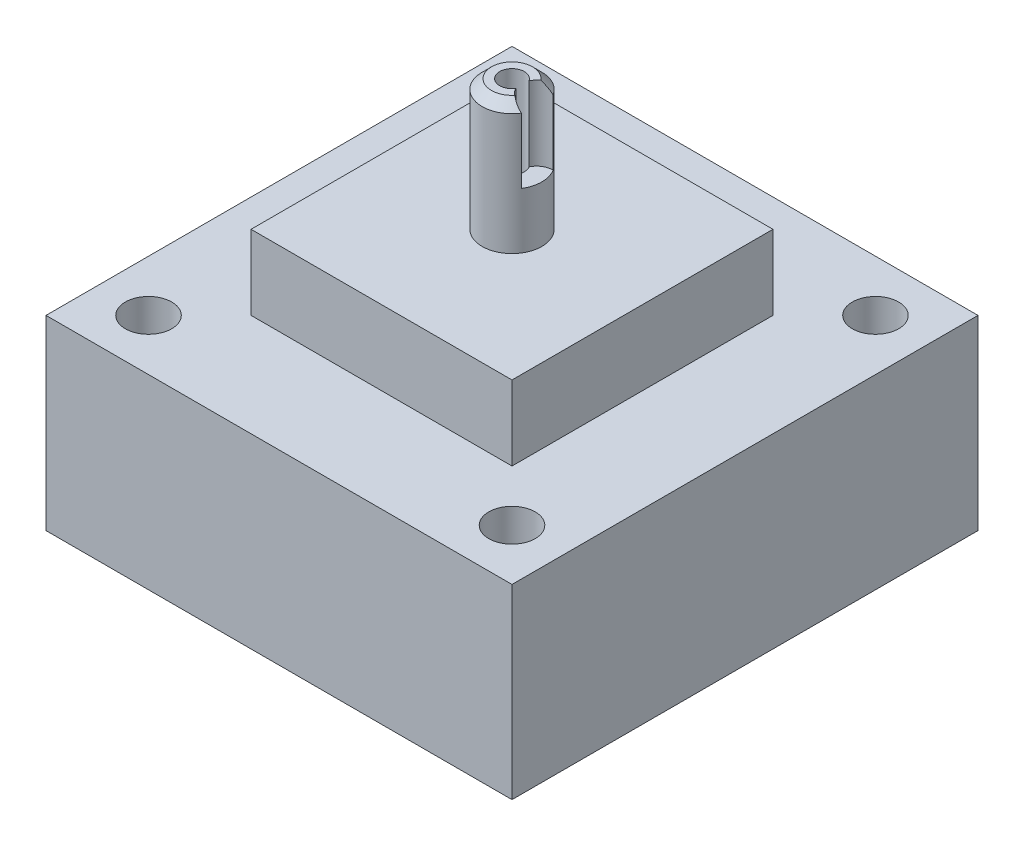
ISO-10303-21;
HEADER;
FILE_DESCRIPTION(('STEP AP214'),'2;1');
FILE_NAME('part.step','',(''),(''),'','','');
FILE_SCHEMA(('AUTOMOTIVE_DESIGN { 1 0 10303 214 1 1 1 1 }'));
ENDSEC;
DATA;
#1=APPLICATION_CONTEXT('core data for automotive mechanical design processes');
#2=APPLICATION_PROTOCOL_DEFINITION('international standard','automotive_design',2000,#1);
#3=PRODUCT_CONTEXT('',#1,'mechanical');
#4=PRODUCT('Part','Part','',(#3));
#5=PRODUCT_RELATED_PRODUCT_CATEGORY('part','',(#4));
#6=PRODUCT_DEFINITION_FORMATION('','',#4);
#7=PRODUCT_DEFINITION_CONTEXT('part definition',#1,'design');
#8=PRODUCT_DEFINITION('design','',#6,#7);
#9=PRODUCT_DEFINITION_SHAPE('','',#8);
#10=(LENGTH_UNIT() NAMED_UNIT(*) SI_UNIT(.MILLI.,.METRE.));
#11=(NAMED_UNIT(*) PLANE_ANGLE_UNIT() SI_UNIT($,.RADIAN.));
#12=(NAMED_UNIT(*) SI_UNIT($,.STERADIAN.) SOLID_ANGLE_UNIT());
#13=UNCERTAINTY_MEASURE_WITH_UNIT(LENGTH_MEASURE(1.E-05),#10,'distance_accuracy_value','');
#14=(GEOMETRIC_REPRESENTATION_CONTEXT(3) GLOBAL_UNCERTAINTY_ASSIGNED_CONTEXT((#13)) GLOBAL_UNIT_ASSIGNED_CONTEXT((#10,
#11,#12)) REPRESENTATION_CONTEXT('',''));
#15=CARTESIAN_POINT('',(0.,0.,0.));
#16=DIRECTION('',(0.,0.,1.));
#17=DIRECTION('',(1.,0.,0.));
#18=AXIS2_PLACEMENT_3D('',#15,#16,#17);
#19=CARTESIAN_POINT('',(-7.,4.,7.));
#20=DIRECTION('',(1.,0.,0.));
#21=DIRECTION('',(0.,0.,-1.));
#22=AXIS2_PLACEMENT_3D('',#19,#20,#21);
#23=PLANE('',#22);
#24=DIRECTION('',(0.,0.,1.));
#25=VECTOR('',#24,1.);
#26=CARTESIAN_POINT('',(-7.,0.,7.));
#27=LINE('',#26,#25);
#28=CARTESIAN_POINT('',(-7.,0.,-7.));
#29=VERTEX_POINT('',#28);
#30=CARTESIAN_POINT('',(-7.,0.,7.));
#31=VERTEX_POINT('',#30);
#32=EDGE_CURVE('E87',#29,#31,#27,.T.);
#33=ORIENTED_EDGE('',*,*,#32,.T.);
#34=DIRECTION('',(0.,-1.,0.));
#35=VECTOR('',#34,1.);
#36=CARTESIAN_POINT('',(-7.,4.,7.));
#37=LINE('',#36,#35);
#38=CARTESIAN_POINT('',(-7.,4.,7.));
#39=VERTEX_POINT('',#38);
#40=EDGE_CURVE('E110',#39,#31,#37,.T.);
#41=ORIENTED_EDGE('',*,*,#40,.F.);
#42=DIRECTION('',(0.,0.,1.));
#43=VECTOR('',#42,1.);
#44=CARTESIAN_POINT('',(-7.,4.,7.));
#45=LINE('',#44,#43);
#46=CARTESIAN_POINT('',(-7.,4.,-7.));
#47=VERTEX_POINT('',#46);
#48=EDGE_CURVE('E100',#47,#39,#45,.T.);
#49=ORIENTED_EDGE('',*,*,#48,.F.);
#50=DIRECTION('',(0.,-1.,0.));
#51=VECTOR('',#50,1.);
#52=CARTESIAN_POINT('',(-7.,4.,-7.));
#53=LINE('',#52,#51);
#54=EDGE_CURVE('E116',#47,#29,#53,.T.);
#55=ORIENTED_EDGE('',*,*,#54,.T.);
#56=EDGE_LOOP('',(#33,#41,#49,#55));
#57=FACE_BOUND('',#56,.T.);
#58=ADVANCED_FACE('F43',(#57),#23,.F.);
#59=CARTESIAN_POINT('',(-7.,4.,7.));
#60=DIRECTION('',(0.,0.,-1.));
#61=DIRECTION('',(-1.,0.,0.));
#62=AXIS2_PLACEMENT_3D('',#59,#60,#61);
#63=PLANE('',#62);
#64=DIRECTION('',(1.,0.,0.));
#65=VECTOR('',#64,1.);
#66=CARTESIAN_POINT('',(-7.,0.,7.));
#67=LINE('',#66,#65);
#68=CARTESIAN_POINT('',(7.,0.,7.));
#69=VERTEX_POINT('',#68);
#70=EDGE_CURVE('E108',#31,#69,#67,.T.);
#71=ORIENTED_EDGE('',*,*,#70,.T.);
#72=DIRECTION('',(0.,-1.,0.));
#73=VECTOR('',#72,1.);
#74=CARTESIAN_POINT('',(7.,4.,7.));
#75=LINE('',#74,#73);
#76=CARTESIAN_POINT('',(7.,4.,7.));
#77=VERTEX_POINT('',#76);
#78=EDGE_CURVE('E106',#77,#69,#75,.T.);
#79=ORIENTED_EDGE('',*,*,#78,.F.);
#80=DIRECTION('',(1.,0.,0.));
#81=VECTOR('',#80,1.);
#82=CARTESIAN_POINT('',(-7.,4.,7.));
#83=LINE('',#82,#81);
#84=EDGE_CURVE('E93',#39,#77,#83,.T.);
#85=ORIENTED_EDGE('',*,*,#84,.F.);
#86=ORIENTED_EDGE('',*,*,#40,.T.);
#87=EDGE_LOOP('',(#71,#79,#85,#86));
#88=FACE_BOUND('',#87,.T.);
#89=ADVANCED_FACE('F107',(#88),#63,.F.);
#90=CARTESIAN_POINT('',(7.,4.,7.));
#91=DIRECTION('',(-1.,0.,0.));
#92=DIRECTION('',(0.,0.,1.));
#93=AXIS2_PLACEMENT_3D('',#90,#91,#92);
#94=PLANE('',#93);
#95=DIRECTION('',(0.,0.,-1.));
#96=VECTOR('',#95,1.);
#97=CARTESIAN_POINT('',(7.,0.,7.));
#98=LINE('',#97,#96);
#99=CARTESIAN_POINT('',(7.,0.,-7.));
#100=VERTEX_POINT('',#99);
#101=EDGE_CURVE('E79',#69,#100,#98,.T.);
#102=ORIENTED_EDGE('',*,*,#101,.T.);
#103=DIRECTION('',(0.,-1.,0.));
#104=VECTOR('',#103,1.);
#105=CARTESIAN_POINT('',(7.,4.,-7.));
#106=LINE('',#105,#104);
#107=CARTESIAN_POINT('',(7.,4.,-7.));
#108=VERTEX_POINT('',#107);
#109=EDGE_CURVE('E111',#108,#100,#106,.T.);
#110=ORIENTED_EDGE('',*,*,#109,.F.);
#111=DIRECTION('',(0.,0.,-1.));
#112=VECTOR('',#111,1.);
#113=CARTESIAN_POINT('',(7.,4.,7.));
#114=LINE('',#113,#112);
#115=EDGE_CURVE('E97',#77,#108,#114,.T.);
#116=ORIENTED_EDGE('',*,*,#115,.F.);
#117=ORIENTED_EDGE('',*,*,#78,.T.);
#118=EDGE_LOOP('',(#102,#110,#116,#117));
#119=FACE_BOUND('',#118,.T.);
#120=ADVANCED_FACE('F113',(#119),#94,.F.);
#121=CARTESIAN_POINT('',(-7.,4.,-7.));
#122=DIRECTION('',(0.,0.,1.));
#123=DIRECTION('',(1.,0.,0.));
#124=AXIS2_PLACEMENT_3D('',#121,#122,#123);
#125=PLANE('',#124);
#126=DIRECTION('',(-1.,0.,0.));
#127=VECTOR('',#126,1.);
#128=CARTESIAN_POINT('',(-7.,0.,-7.));
#129=LINE('',#128,#127);
#130=EDGE_CURVE('E124',#100,#29,#129,.T.);
#131=ORIENTED_EDGE('',*,*,#130,.T.);
#132=ORIENTED_EDGE('',*,*,#54,.F.);
#133=DIRECTION('',(-1.,0.,0.));
#134=VECTOR('',#133,1.);
#135=CARTESIAN_POINT('',(-7.,4.,-7.));
#136=LINE('',#135,#134);
#137=EDGE_CURVE('E66',#108,#47,#136,.T.);
#138=ORIENTED_EDGE('',*,*,#137,.F.);
#139=ORIENTED_EDGE('',*,*,#109,.T.);
#140=EDGE_LOOP('',(#131,#132,#138,#139));
#141=FACE_BOUND('',#140,.T.);
#142=ADVANCED_FACE('F359',(#141),#125,.F.);
#143=CARTESIAN_POINT('',(0.,4.,0.));
#144=DIRECTION('',(0.,-1.,0.));
#145=DIRECTION('',(0.,0.,-1.));
#146=AXIS2_PLACEMENT_3D('',#143,#144,#145);
#147=PLANE('',#146);
#148=CARTESIAN_POINT('',(0.,4.,0.));
#149=DIRECTION('',(0.,-1.,0.));
#150=DIRECTION('',(0.,0.,-1.));
#151=AXIS2_PLACEMENT_3D('',#148,#149,#150);
#152=CIRCLE('',#151,1.6);
#153=CARTESIAN_POINT('',(0.,4.,-1.6));
#154=VERTEX_POINT('',#153);
#155=EDGE_CURVE('E236',#154,#154,#152,.T.);
#156=ORIENTED_EDGE('',*,*,#155,.T.);
#157=EDGE_LOOP('',(#156));
#158=FACE_BOUND('',#157,.T.);
#159=ORIENTED_EDGE('',*,*,#48,.T.);
#160=ORIENTED_EDGE('',*,*,#84,.T.);
#161=ORIENTED_EDGE('',*,*,#115,.T.);
#162=ORIENTED_EDGE('',*,*,#137,.T.);
#163=EDGE_LOOP('',(#159,#160,#161,#162));
#164=FACE_BOUND('',#163,.T.);
#165=ADVANCED_FACE('F95',(#158,#164),#147,.F.);
#166=CARTESIAN_POINT('',(0.,-10.,0.));
#167=DIRECTION('',(0.,-1.,0.));
#168=DIRECTION('',(0.,0.,-1.));
#169=AXIS2_PLACEMENT_3D('',#166,#167,#168);
#170=PLANE('',#169);
#171=CARTESIAN_POINT('',(0.,-10.,0.));
#172=DIRECTION('',(0.,-1.,0.));
#173=DIRECTION('',(0.,0.,-1.));
#174=AXIS2_PLACEMENT_3D('',#171,#172,#173);
#175=CIRCLE('',#174,4.23);
#176=CARTESIAN_POINT('',(0.,-10.,-4.23));
#177=VERTEX_POINT('',#176);
#178=EDGE_CURVE('E244',#177,#177,#175,.T.);
#179=ORIENTED_EDGE('',*,*,#178,.F.);
#180=EDGE_LOOP('',(#179));
#181=FACE_BOUND('',#180,.T.);
#182=CARTESIAN_POINT('',(9.74999999999993,-10.,-9.75000000000006));
#183=DIRECTION('',(0.,-1.,0.));
#184=DIRECTION('',(0.,0.,-1.));
#185=AXIS2_PLACEMENT_3D('',#182,#183,#184);
#186=CIRCLE('',#185,1.2446);
#187=CARTESIAN_POINT('',(9.74999999999993,-10.,-10.9946000000001));
#188=VERTEX_POINT('',#187);
#189=EDGE_CURVE('E257',#188,#188,#186,.T.);
#190=ORIENTED_EDGE('',*,*,#189,.F.);
#191=EDGE_LOOP('',(#190));
#192=FACE_BOUND('',#191,.T.);
#193=CARTESIAN_POINT('',(-9.75,-10.,9.75));
#194=DIRECTION('',(0.,-1.,0.));
#195=DIRECTION('',(0.,0.,-1.));
#196=AXIS2_PLACEMENT_3D('',#193,#194,#195);
#197=CIRCLE('',#196,1.2446);
#198=CARTESIAN_POINT('',(-9.75,-10.,8.5054));
#199=VERTEX_POINT('',#198);
#200=EDGE_CURVE('E269',#199,#199,#197,.T.);
#201=ORIENTED_EDGE('',*,*,#200,.F.);
#202=EDGE_LOOP('',(#201));
#203=FACE_BOUND('',#202,.T.);
#204=DIRECTION('',(1.,0.,0.));
#205=VECTOR('',#204,1.);
#206=CARTESIAN_POINT('',(-12.5,-10.,-12.5));
#207=LINE('',#206,#205);
#208=CARTESIAN_POINT('',(-12.5,-10.,-12.5));
#209=VERTEX_POINT('',#208);
#210=CARTESIAN_POINT('',(12.5,-10.,-12.5));
#211=VERTEX_POINT('',#210);
#212=EDGE_CURVE('E275',#209,#211,#207,.T.);
#213=ORIENTED_EDGE('',*,*,#212,.T.);
#214=DIRECTION('',(0.,0.,1.));
#215=VECTOR('',#214,1.);
#216=CARTESIAN_POINT('',(12.5,-10.,-12.5));
#217=LINE('',#216,#215);
#218=CARTESIAN_POINT('',(12.5,-10.,12.5));
#219=VERTEX_POINT('',#218);
#220=EDGE_CURVE('E278',#211,#219,#217,.T.);
#221=ORIENTED_EDGE('',*,*,#220,.T.);
#222=DIRECTION('',(-1.,0.,0.));
#223=VECTOR('',#222,1.);
#224=CARTESIAN_POINT('',(-12.5,-10.,12.5));
#225=LINE('',#224,#223);
#226=CARTESIAN_POINT('',(-12.5,-10.,12.5));
#227=VERTEX_POINT('',#226);
#228=EDGE_CURVE('E281',#219,#227,#225,.T.);
#229=ORIENTED_EDGE('',*,*,#228,.T.);
#230=DIRECTION('',(0.,0.,-1.));
#231=VECTOR('',#230,1.);
#232=CARTESIAN_POINT('',(-12.5,-10.,-12.5));
#233=LINE('',#232,#231);
#234=EDGE_CURVE('E283',#227,#209,#233,.T.);
#235=ORIENTED_EDGE('',*,*,#234,.T.);
#236=EDGE_LOOP('',(#213,#221,#229,#235));
#237=FACE_BOUND('',#236,.T.);
#238=CARTESIAN_POINT('',(9.75000000000004,-10.,9.74999999999996));
#239=DIRECTION('',(0.,-1.,0.));
#240=DIRECTION('',(0.,0.,-1.));
#241=AXIS2_PLACEMENT_3D('',#238,#239,#240);
#242=CIRCLE('',#241,1.2446);
#243=CARTESIAN_POINT('',(9.75000000000004,-10.,8.50539999999996));
#244=VERTEX_POINT('',#243);
#245=EDGE_CURVE('E263',#244,#244,#242,.T.);
#246=ORIENTED_EDGE('',*,*,#245,.F.);
#247=EDGE_LOOP('',(#246));
#248=FACE_BOUND('',#247,.T.);
#249=CARTESIAN_POINT('',(-9.7500000000001,-10.,-9.7499999999999));
#250=DIRECTION('',(0.,-1.,0.));
#251=DIRECTION('',(0.,0.,-1.));
#252=AXIS2_PLACEMENT_3D('',#249,#250,#251);
#253=CIRCLE('',#252,1.2446);
#254=CARTESIAN_POINT('',(-9.7500000000001,-10.,-10.9945999999999));
#255=VERTEX_POINT('',#254);
#256=EDGE_CURVE('E251',#255,#255,#253,.T.);
#257=ORIENTED_EDGE('',*,*,#256,.F.);
#258=EDGE_LOOP('',(#257));
#259=FACE_BOUND('',#258,.T.);
#260=ADVANCED_FACE('F324',(#181,#192,#203,#237,#248,#259),#170,.T.);
#261=CARTESIAN_POINT('',(0.,0.,0.));
#262=DIRECTION('',(0.,-1.,0.));
#263=DIRECTION('',(0.,0.,-1.));
#264=AXIS2_PLACEMENT_3D('',#261,#262,#263);
#265=PLANE('',#264);
#266=ORIENTED_EDGE('',*,*,#32,.F.);
#267=ORIENTED_EDGE('',*,*,#130,.F.);
#268=ORIENTED_EDGE('',*,*,#101,.F.);
#269=ORIENTED_EDGE('',*,*,#70,.F.);
#270=EDGE_LOOP('',(#266,#267,#268,#269));
#271=FACE_BOUND('',#270,.T.);
#272=DIRECTION('',(1.,0.,0.));
#273=VECTOR('',#272,1.);
#274=CARTESIAN_POINT('',(-12.5,0.,-12.5));
#275=LINE('',#274,#273);
#276=CARTESIAN_POINT('',(-12.5,0.,-12.5));
#277=VERTEX_POINT('',#276);
#278=CARTESIAN_POINT('',(12.5,0.,-12.5));
#279=VERTEX_POINT('',#278);
#280=EDGE_CURVE('E272',#277,#279,#275,.T.);
#281=ORIENTED_EDGE('',*,*,#280,.F.);
#282=DIRECTION('',(0.,0.,-1.));
#283=VECTOR('',#282,1.);
#284=CARTESIAN_POINT('',(-12.5,0.,-12.5));
#285=LINE('',#284,#283);
#286=CARTESIAN_POINT('',(-12.5,0.,12.5));
#287=VERTEX_POINT('',#286);
#288=EDGE_CURVE('E279',#287,#277,#285,.T.);
#289=ORIENTED_EDGE('',*,*,#288,.F.);
#290=DIRECTION('',(-1.,0.,0.));
#291=VECTOR('',#290,1.);
#292=CARTESIAN_POINT('',(-12.5,0.,12.5));
#293=LINE('',#292,#291);
#294=CARTESIAN_POINT('',(12.5,0.,12.5));
#295=VERTEX_POINT('',#294);
#296=EDGE_CURVE('E290',#295,#287,#293,.T.);
#297=ORIENTED_EDGE('',*,*,#296,.F.);
#298=DIRECTION('',(0.,0.,1.));
#299=VECTOR('',#298,1.);
#300=CARTESIAN_POINT('',(12.5,0.,-12.5));
#301=LINE('',#300,#299);
#302=EDGE_CURVE('E288',#279,#295,#301,.T.);
#303=ORIENTED_EDGE('',*,*,#302,.F.);
#304=EDGE_LOOP('',(#281,#289,#297,#303));
#305=FACE_BOUND('',#304,.T.);
#306=CARTESIAN_POINT('',(-9.75,0.,9.75));
#307=DIRECTION('',(0.,-1.,0.));
#308=DIRECTION('',(0.,0.,-1.));
#309=AXIS2_PLACEMENT_3D('',#306,#307,#308);
#310=CIRCLE('',#309,1.2446);
#311=CARTESIAN_POINT('',(-9.75,0.,8.5054));
#312=VERTEX_POINT('',#311);
#313=EDGE_CURVE('E266',#312,#312,#310,.T.);
#314=ORIENTED_EDGE('',*,*,#313,.T.);
#315=EDGE_LOOP('',(#314));
#316=FACE_BOUND('',#315,.T.);
#317=CARTESIAN_POINT('',(9.75000000000004,0.,9.74999999999996));
#318=DIRECTION('',(0.,-1.,0.));
#319=DIRECTION('',(0.,0.,-1.));
#320=AXIS2_PLACEMENT_3D('',#317,#318,#319);
#321=CIRCLE('',#320,1.2446);
#322=CARTESIAN_POINT('',(9.75000000000004,0.,8.50539999999996));
#323=VERTEX_POINT('',#322);
#324=EDGE_CURVE('E260',#323,#323,#321,.T.);
#325=ORIENTED_EDGE('',*,*,#324,.T.);
#326=EDGE_LOOP('',(#325));
#327=FACE_BOUND('',#326,.T.);
#328=CARTESIAN_POINT('',(9.74999999999993,0.,-9.75000000000006));
#329=DIRECTION('',(0.,-1.,0.));
#330=DIRECTION('',(0.,0.,-1.));
#331=AXIS2_PLACEMENT_3D('',#328,#329,#330);
#332=CIRCLE('',#331,1.2446);
#333=CARTESIAN_POINT('',(9.74999999999993,0.,-10.9946000000001));
#334=VERTEX_POINT('',#333);
#335=EDGE_CURVE('E254',#334,#334,#332,.T.);
#336=ORIENTED_EDGE('',*,*,#335,.T.);
#337=EDGE_LOOP('',(#336));
#338=FACE_BOUND('',#337,.T.);
#339=CARTESIAN_POINT('',(-9.7500000000001,0.,-9.7499999999999));
#340=DIRECTION('',(0.,-1.,0.));
#341=DIRECTION('',(0.,0.,-1.));
#342=AXIS2_PLACEMENT_3D('',#339,#340,#341);
#343=CIRCLE('',#342,1.2446);
#344=CARTESIAN_POINT('',(-9.7500000000001,0.,-10.9945999999999));
#345=VERTEX_POINT('',#344);
#346=EDGE_CURVE('E248',#345,#345,#343,.T.);
#347=ORIENTED_EDGE('',*,*,#346,.T.);
#348=EDGE_LOOP('',(#347));
#349=FACE_BOUND('',#348,.T.);
#350=ADVANCED_FACE('F313',(#271,#305,#316,#327,#338,#349),#265,.F.);
#351=CARTESIAN_POINT('',(-12.5,-10.,-12.5));
#352=DIRECTION('',(0.,0.,1.));
#353=DIRECTION('',(1.,0.,0.));
#354=AXIS2_PLACEMENT_3D('',#351,#352,#353);
#355=PLANE('',#354);
#356=ORIENTED_EDGE('',*,*,#280,.T.);
#357=DIRECTION('',(0.,1.,0.));
#358=VECTOR('',#357,1.);
#359=CARTESIAN_POINT('',(12.5,-10.,-12.5));
#360=LINE('',#359,#358);
#361=EDGE_CURVE('E121',#211,#279,#360,.T.);
#362=ORIENTED_EDGE('',*,*,#361,.F.);
#363=ORIENTED_EDGE('',*,*,#212,.F.);
#364=DIRECTION('',(0.,1.,0.));
#365=VECTOR('',#364,1.);
#366=CARTESIAN_POINT('',(-12.5,-10.,-12.5));
#367=LINE('',#366,#365);
#368=EDGE_CURVE('E285',#209,#277,#367,.T.);
#369=ORIENTED_EDGE('',*,*,#368,.T.);
#370=EDGE_LOOP('',(#356,#362,#363,#369));
#371=FACE_BOUND('',#370,.T.);
#372=ADVANCED_FACE('F309',(#371),#355,.F.);
#373=CARTESIAN_POINT('',(12.5,-10.,-12.5));
#374=DIRECTION('',(-1.,0.,0.));
#375=DIRECTION('',(0.,0.,1.));
#376=AXIS2_PLACEMENT_3D('',#373,#374,#375);
#377=PLANE('',#376);
#378=ORIENTED_EDGE('',*,*,#302,.T.);
#379=DIRECTION('',(0.,1.,0.));
#380=VECTOR('',#379,1.);
#381=CARTESIAN_POINT('',(12.5,-10.,12.5));
#382=LINE('',#381,#380);
#383=EDGE_CURVE('E298',#219,#295,#382,.T.);
#384=ORIENTED_EDGE('',*,*,#383,.F.);
#385=ORIENTED_EDGE('',*,*,#220,.F.);
#386=ORIENTED_EDGE('',*,*,#361,.T.);
#387=EDGE_LOOP('',(#378,#384,#385,#386));
#388=FACE_BOUND('',#387,.T.);
#389=ADVANCED_FACE('F304',(#388),#377,.F.);
#390=CARTESIAN_POINT('',(-12.5,-10.,12.5));
#391=DIRECTION('',(0.,0.,-1.));
#392=DIRECTION('',(-1.,0.,0.));
#393=AXIS2_PLACEMENT_3D('',#390,#391,#392);
#394=PLANE('',#393);
#395=ORIENTED_EDGE('',*,*,#296,.T.);
#396=DIRECTION('',(0.,1.,0.));
#397=VECTOR('',#396,1.);
#398=CARTESIAN_POINT('',(-12.5,-10.,12.5));
#399=LINE('',#398,#397);
#400=EDGE_CURVE('E295',#227,#287,#399,.T.);
#401=ORIENTED_EDGE('',*,*,#400,.F.);
#402=ORIENTED_EDGE('',*,*,#228,.F.);
#403=ORIENTED_EDGE('',*,*,#383,.T.);
#404=EDGE_LOOP('',(#395,#401,#402,#403));
#405=FACE_BOUND('',#404,.T.);
#406=ADVANCED_FACE('F318',(#405),#394,.F.);
#407=CARTESIAN_POINT('',(-12.5,-10.,-12.5));
#408=DIRECTION('',(1.,0.,0.));
#409=DIRECTION('',(0.,0.,-1.));
#410=AXIS2_PLACEMENT_3D('',#407,#408,#409);
#411=PLANE('',#410);
#412=ORIENTED_EDGE('',*,*,#288,.T.);
#413=ORIENTED_EDGE('',*,*,#368,.F.);
#414=ORIENTED_EDGE('',*,*,#234,.F.);
#415=ORIENTED_EDGE('',*,*,#400,.T.);
#416=EDGE_LOOP('',(#412,#413,#414,#415));
#417=FACE_BOUND('',#416,.T.);
#418=ADVANCED_FACE('F322',(#417),#411,.F.);
#419=CARTESIAN_POINT('',(-9.75,-10.,9.75));
#420=DIRECTION('',(0.,1.,0.));
#421=DIRECTION('',(0.,0.,1.));
#422=AXIS2_PLACEMENT_3D('',#419,#420,#421);
#423=CYLINDRICAL_SURFACE('',#422,1.2446);
#424=ORIENTED_EDGE('',*,*,#200,.T.);
#425=EDGE_LOOP('',(#424));
#426=FACE_BOUND('',#425,.T.);
#427=ORIENTED_EDGE('',*,*,#313,.F.);
#428=EDGE_LOOP('',(#427));
#429=FACE_BOUND('',#428,.T.);
#430=ADVANCED_FACE('F352',(#426,#429),#423,.F.);
#431=CARTESIAN_POINT('',(9.75000000000004,-10.,9.74999999999996));
#432=DIRECTION('',(0.,1.,0.));
#433=DIRECTION('',(0.,0.,1.));
#434=AXIS2_PLACEMENT_3D('',#431,#432,#433);
#435=CYLINDRICAL_SURFACE('',#434,1.2446);
#436=ORIENTED_EDGE('',*,*,#245,.T.);
#437=EDGE_LOOP('',(#436));
#438=FACE_BOUND('',#437,.T.);
#439=ORIENTED_EDGE('',*,*,#324,.F.);
#440=EDGE_LOOP('',(#439));
#441=FACE_BOUND('',#440,.T.);
#442=ADVANCED_FACE('F425',(#438,#441),#435,.F.);
#443=CARTESIAN_POINT('',(9.74999999999993,-10.,-9.75000000000006));
#444=DIRECTION('',(0.,1.,0.));
#445=DIRECTION('',(0.,0.,1.));
#446=AXIS2_PLACEMENT_3D('',#443,#444,#445);
#447=CYLINDRICAL_SURFACE('',#446,1.2446);
#448=ORIENTED_EDGE('',*,*,#189,.T.);
#449=EDGE_LOOP('',(#448));
#450=FACE_BOUND('',#449,.T.);
#451=ORIENTED_EDGE('',*,*,#335,.F.);
#452=EDGE_LOOP('',(#451));
#453=FACE_BOUND('',#452,.T.);
#454=ADVANCED_FACE('F337',(#450,#453),#447,.F.);
#455=CARTESIAN_POINT('',(-9.7500000000001,-10.,-9.7499999999999));
#456=DIRECTION('',(0.,1.,0.));
#457=DIRECTION('',(0.,0.,1.));
#458=AXIS2_PLACEMENT_3D('',#455,#456,#457);
#459=CYLINDRICAL_SURFACE('',#458,1.2446);
#460=ORIENTED_EDGE('',*,*,#256,.T.);
#461=EDGE_LOOP('',(#460));
#462=FACE_BOUND('',#461,.T.);
#463=ORIENTED_EDGE('',*,*,#346,.F.);
#464=EDGE_LOOP('',(#463));
#465=FACE_BOUND('',#464,.T.);
#466=ADVANCED_FACE('F333',(#462,#465),#459,.F.);
#467=CARTESIAN_POINT('',(0.,-0.199999999999999,0.));
#468=DIRECTION('',(0.,-1.,0.));
#469=DIRECTION('',(0.,0.,-1.));
#470=AXIS2_PLACEMENT_3D('',#467,#468,#469);
#471=CYLINDRICAL_SURFACE('',#470,4.23);
#472=CARTESIAN_POINT('',(0.,-0.199999999999999,0.));
#473=DIRECTION('',(0.,-1.,0.));
#474=DIRECTION('',(0.,0.,-1.));
#475=AXIS2_PLACEMENT_3D('',#472,#473,#474);
#476=CIRCLE('',#475,4.23);
#477=CARTESIAN_POINT('',(0.,-0.199999999999999,-4.23));
#478=VERTEX_POINT('',#477);
#479=EDGE_CURVE('E245',#478,#478,#476,.T.);
#480=ORIENTED_EDGE('',*,*,#479,.F.);
#481=EDGE_LOOP('',(#480));
#482=FACE_BOUND('',#481,.T.);
#483=ORIENTED_EDGE('',*,*,#178,.T.);
#484=EDGE_LOOP('',(#483));
#485=FACE_BOUND('',#484,.T.);
#486=ADVANCED_FACE('F336',(#482,#485),#471,.F.);
#487=CARTESIAN_POINT('',(0.,-0.199999999999999,0.));
#488=DIRECTION('',(0.,-1.,0.));
#489=DIRECTION('',(0.,0.,-1.));
#490=AXIS2_PLACEMENT_3D('',#487,#488,#489);
#491=PLANE('',#490);
#492=CARTESIAN_POINT('',(0.,-0.199999999999999,0.));
#493=DIRECTION('',(0.,-1.,0.));
#494=DIRECTION('',(0.,0.,-1.));
#495=AXIS2_PLACEMENT_3D('',#492,#493,#494);
#496=CIRCLE('',#495,0.660399999999999);
#497=CARTESIAN_POINT('',(0.,-0.199999999999999,-0.660399999999999));
#498=VERTEX_POINT('',#497);
#499=EDGE_CURVE('E131',#498,#498,#496,.T.);
#500=ORIENTED_EDGE('',*,*,#499,.F.);
#501=EDGE_LOOP('',(#500));
#502=FACE_BOUND('',#501,.T.);
#503=ORIENTED_EDGE('',*,*,#479,.T.);
#504=EDGE_LOOP('',(#503));
#505=FACE_BOUND('',#504,.T.);
#506=ADVANCED_FACE('F457',(#502,#505),#491,.T.);
#507=CARTESIAN_POINT('',(0.,11.,-1.1));
#508=DIRECTION('',(0.,1.,0.));
#509=DIRECTION('',(0.,0.,1.));
#510=AXIS2_PLACEMENT_3D('',#507,#508,#509);
#511=PLANE('',#510);
#512=CARTESIAN_POINT('',(1.33462181153422,11.,0.));
#513=DIRECTION('',(0.,1.,0.));
#514=DIRECTION('',(0.,0.,1.));
#515=AXIS2_PLACEMENT_3D('',#512,#513,#514);
#516=CIRCLE('',#515,0.85);
#517=CARTESIAN_POINT('',(0.849946913880746,11.,-0.698276623971186));
#518=VERTEX_POINT('',#517);
#519=CARTESIAN_POINT('',(0.560025142292735,11.,-0.350000000000004));
#520=VERTEX_POINT('',#519);
#521=EDGE_CURVE('E217',#518,#520,#516,.T.);
#522=ORIENTED_EDGE('',*,*,#521,.F.);
#523=CARTESIAN_POINT('',(0.,11.,0.));
#524=DIRECTION('',(0.,-1.,0.));
#525=DIRECTION('',(0.,0.,-1.));
#526=AXIS2_PLACEMENT_3D('',#523,#524,#525);
#527=CIRCLE('',#526,1.1);
#528=CARTESIAN_POINT('',(0.849946913880746,11.,0.698276623971186));
#529=VERTEX_POINT('',#528);
#530=EDGE_CURVE('E134',#529,#518,#527,.T.);
#531=ORIENTED_EDGE('',*,*,#530,.F.);
#532=CARTESIAN_POINT('',(0.560025142292735,11.,0.350000000000004));
#533=VERTEX_POINT('',#532);
#534=EDGE_CURVE('E231',#533,#529,#516,.T.);
#535=ORIENTED_EDGE('',*,*,#534,.F.);
#536=CARTESIAN_POINT('',(0.,11.,0.));
#537=DIRECTION('',(0.,-1.,0.));
#538=DIRECTION('',(0.,0.,-1.));
#539=AXIS2_PLACEMENT_3D('',#536,#537,#538);
#540=CIRCLE('',#539,0.6604);
#541=EDGE_CURVE('E229',#533,#520,#540,.T.);
#542=ORIENTED_EDGE('',*,*,#541,.T.);
#543=EDGE_LOOP('',(#522,#531,#535,#542));
#544=FACE_BOUND('',#543,.T.);
#545=ADVANCED_FACE('F226',(#544),#511,.T.);
#546=CARTESIAN_POINT('',(0.,4.,0.));
#547=DIRECTION('',(0.,-1.,0.));
#548=DIRECTION('',(0.,0.,-1.));
#549=AXIS2_PLACEMENT_3D('',#546,#547,#548);
#550=CYLINDRICAL_SURFACE('',#549,0.660400000000001);
#551=DIRECTION('',(0.,1.,0.));
#552=VECTOR('',#551,1.);
#553=CARTESIAN_POINT('',(0.560025142292735,9.,0.350000000000004));
#554=LINE('',#553,#552);
#555=CARTESIAN_POINT('',(0.560025142292735,7.,0.350000000000004));
#556=VERTEX_POINT('',#555);
#557=EDGE_CURVE('E525',#556,#533,#554,.T.);
#558=ORIENTED_EDGE('',*,*,#557,.F.);
#559=CARTESIAN_POINT('',(0.,7.,0.));
#560=DIRECTION('',(0.,1.,0.));
#561=DIRECTION('',(0.,0.,1.));
#562=AXIS2_PLACEMENT_3D('',#559,#560,#561);
#563=CIRCLE('',#562,0.660400000000001);
#564=CARTESIAN_POINT('',(0.560025142292735,7.,-0.350000000000003));
#565=VERTEX_POINT('',#564);
#566=EDGE_CURVE('E135',#556,#565,#563,.T.);
#567=ORIENTED_EDGE('',*,*,#566,.T.);
#568=DIRECTION('',(0.,1.,0.));
#569=VECTOR('',#568,1.);
#570=CARTESIAN_POINT('',(0.560025142292735,9.,-0.350000000000003));
#571=LINE('',#570,#569);
#572=EDGE_CURVE('E527',#520,#565,#571,.F.);
#573=ORIENTED_EDGE('',*,*,#572,.F.);
#574=ORIENTED_EDGE('',*,*,#541,.F.);
#575=EDGE_LOOP('',(#558,#567,#573,#574));
#576=FACE_BOUND('',#575,.T.);
#577=ORIENTED_EDGE('',*,*,#499,.T.);
#578=EDGE_LOOP('',(#577));
#579=FACE_BOUND('',#578,.T.);
#580=ADVANCED_FACE('F475',(#576,#579),#550,.F.);
#581=CARTESIAN_POINT('',(0.,4.,0.));
#582=DIRECTION('',(0.,-1.,0.));
#583=DIRECTION('',(0.,0.,-1.));
#584=AXIS2_PLACEMENT_3D('',#581,#582,#583);
#585=CYLINDRICAL_SURFACE('',#584,1.6);
#586=DIRECTION('',(0.,1.,0.));
#587=VECTOR('',#586,1.);
#588=CARTESIAN_POINT('',(1.35570816711851,9.,0.849738410105236));
#589=LINE('',#588,#587);
#590=CARTESIAN_POINT('',(1.35570816711851,10.5,0.849738410105235));
#591=VERTEX_POINT('',#590);
#592=CARTESIAN_POINT('',(1.35570816711851,7.,0.849738410105237));
#593=VERTEX_POINT('',#592);
#594=EDGE_CURVE('E530',#591,#593,#589,.F.);
#595=ORIENTED_EDGE('',*,*,#594,.F.);
#596=CARTESIAN_POINT('',(0.,10.5,0.));
#597=DIRECTION('',(0.,-1.,0.));
#598=DIRECTION('',(0.,0.,-1.));
#599=AXIS2_PLACEMENT_3D('',#596,#597,#598);
#600=CIRCLE('',#599,1.6);
#601=CARTESIAN_POINT('',(1.35570816711851,10.5,-0.849738410105235));
#602=VERTEX_POINT('',#601);
#603=EDGE_CURVE('E234',#591,#602,#600,.T.);
#604=ORIENTED_EDGE('',*,*,#603,.T.);
#605=DIRECTION('',(0.,1.,0.));
#606=VECTOR('',#605,1.);
#607=CARTESIAN_POINT('',(1.35570816711851,9.,-0.849738410105235));
#608=LINE('',#607,#606);
#609=CARTESIAN_POINT('',(1.35570816711851,7.,-0.849738410105234));
#610=VERTEX_POINT('',#609);
#611=EDGE_CURVE('E57',#610,#602,#608,.T.);
#612=ORIENTED_EDGE('',*,*,#611,.F.);
#613=CARTESIAN_POINT('',(0.,7.,0.));
#614=DIRECTION('',(0.,1.,0.));
#615=DIRECTION('',(0.,0.,1.));
#616=AXIS2_PLACEMENT_3D('',#613,#614,#615);
#617=CIRCLE('',#616,1.6);
#618=EDGE_CURVE('E11',#610,#593,#617,.F.);
#619=ORIENTED_EDGE('',*,*,#618,.T.);
#620=EDGE_LOOP('',(#595,#604,#612,#619));
#621=FACE_BOUND('',#620,.T.);
#622=ORIENTED_EDGE('',*,*,#155,.F.);
#623=EDGE_LOOP('',(#622));
#624=FACE_BOUND('',#623,.T.);
#625=ADVANCED_FACE('F485',(#621,#624),#585,.T.);
#626=CARTESIAN_POINT('',(0.,10.5,0.));
#627=DIRECTION('',(0.,-1.,0.));
#628=DIRECTION('',(0.,0.,-1.));
#629=AXIS2_PLACEMENT_3D('',#626,#627,#628);
#630=CONICAL_SURFACE('',#629,1.6,0.785398163397444);
#631=CARTESIAN_POINT('',(0.849782088161512,11.0002,0.698162189351356));
#632=CARTESIAN_POINT('',(0.877053510692027,10.9671037737641,0.717087158494492));
#633=CARTESIAN_POINT('',(0.905473053435397,10.9341144012926,0.734466409644646));
#634=CARTESIAN_POINT('',(0.964485171793755,10.8684105466202,0.765914501347974));
#635=CARTESIAN_POINT('',(0.995080773336042,10.8356965208475,0.779978610047482));
#636=CARTESIAN_POINT('',(1.08838863682259,10.7396782629569,0.816236160822723));
#637=CARTESIAN_POINT('',(1.1538808826904,10.6769812132615,0.833375214801903));
#638=CARTESIAN_POINT('',(1.24359400348404,10.5962940649367,0.845400537792543));
#639=CARTESIAN_POINT('',(1.26568975470549,10.576814650626,0.847495617524275));
#640=CARTESIAN_POINT('',(1.31044818441416,10.5380892409397,0.849952859972657));
#641=CARTESIAN_POINT('',(1.33311373007387,10.5188457977135,0.850302916251037));
#642=CARTESIAN_POINT('',(1.35594795040185,10.4998,0.849732426003032));
#643=B_SPLINE_CURVE_WITH_KNOTS('',3,(#631,#632,#633,#634,#635,#636,#637,#638,#639,#640,#641,
#642),.UNSPECIFIED.,.F.,.F.,(4,2,2,2,2,4),(0.,0.140516106837514,0.28123158038627,
0.556263324374228,0.6448155870777,0.733981351479915),.UNSPECIFIED.);
#644=EDGE_CURVE('E50',#529,#591,#643,.T.);
#645=ORIENTED_EDGE('',*,*,#644,.F.);
#646=ORIENTED_EDGE('',*,*,#530,.T.);
#647=CARTESIAN_POINT('',(1.35594795040185,10.4998,-0.849732426003032));
#648=CARTESIAN_POINT('',(1.30026902929933,10.546199682894,-0.851119851826231));
#649=CARTESIAN_POINT('',(1.24562463255125,10.5938296574253,-0.84703551698532));
#650=CARTESIAN_POINT('',(1.14046248649939,10.6901395205334,-0.829217183843809));
#651=CARTESIAN_POINT('',(1.08989341732027,10.7387911842944,-0.815635695283616));
#652=CARTESIAN_POINT('',(1.0073714808151,10.8227309519079,-0.785322993027269));
#653=CARTESIAN_POINT('',(0.974323182122427,10.8577334486563,-0.770698468869442));
#654=CARTESIAN_POINT('',(0.910299811230155,10.9285195637332,-0.737403166835605));
#655=CARTESIAN_POINT('',(0.879352175731535,10.9643075398141,-0.718688811632332));
#656=CARTESIAN_POINT('',(0.849782088161512,11.0002,-0.698162189351356));
#657=B_SPLINE_CURVE_WITH_KNOTS('',3,(#647,#648,#649,#650,#651,#652,#653,#654,#655,#656),
.UNSPECIFIED.,.F.,.F.,(4,2,2,2,4),(0.,0.217105632470158,0.430802633762501,0.581543453567035,
0.733976372663239),.UNSPECIFIED.);
#658=EDGE_CURVE('E130',#602,#518,#657,.T.);
#659=ORIENTED_EDGE('',*,*,#658,.F.);
#660=ORIENTED_EDGE('',*,*,#603,.F.);
#661=EDGE_LOOP('',(#645,#646,#659,#660));
#662=FACE_BOUND('',#661,.T.);
#663=ADVANCED_FACE('F146',(#662),#630,.T.);
#664=CARTESIAN_POINT('',(1.33462181153422,7.,0.));
#665=DIRECTION('',(0.,1.,0.));
#666=DIRECTION('',(0.,0.,1.));
#667=AXIS2_PLACEMENT_3D('',#664,#665,#666);
#668=CYLINDRICAL_SURFACE('',#667,0.85);
#669=ORIENTED_EDGE('',*,*,#557,.T.);
#670=ORIENTED_EDGE('',*,*,#534,.T.);
#671=ORIENTED_EDGE('',*,*,#644,.T.);
#672=ORIENTED_EDGE('',*,*,#594,.T.);
#673=CARTESIAN_POINT('',(1.33462181153422,7.,0.));
#674=DIRECTION('',(0.,1.,0.));
#675=DIRECTION('',(0.,0.,1.));
#676=AXIS2_PLACEMENT_3D('',#673,#674,#675);
#677=CIRCLE('',#676,0.85);
#678=EDGE_CURVE('E230',#556,#593,#677,.T.);
#679=ORIENTED_EDGE('',*,*,#678,.F.);
#680=EDGE_LOOP('',(#669,#670,#671,#672,#679));
#681=FACE_BOUND('',#680,.T.);
#682=ADVANCED_FACE('F154',(#681),#668,.F.);
#683=ORIENTED_EDGE('',*,*,#572,.T.);
#684=EDGE_CURVE('E534',#610,#565,#677,.T.);
#685=ORIENTED_EDGE('',*,*,#684,.F.);
#686=ORIENTED_EDGE('',*,*,#611,.T.);
#687=ORIENTED_EDGE('',*,*,#658,.T.);
#688=ORIENTED_EDGE('',*,*,#521,.T.);
#689=EDGE_LOOP('',(#683,#685,#686,#687,#688));
#690=FACE_BOUND('',#689,.T.);
#691=ADVANCED_FACE('F149',(#690),#668,.F.);
#692=CARTESIAN_POINT('',(1.33462181153422,7.,0.));
#693=DIRECTION('',(0.,1.,0.));
#694=DIRECTION('',(0.,0.,1.));
#695=AXIS2_PLACEMENT_3D('',#692,#693,#694);
#696=PLANE('',#695);
#697=ORIENTED_EDGE('',*,*,#678,.T.);
#698=ORIENTED_EDGE('',*,*,#618,.F.);
#699=ORIENTED_EDGE('',*,*,#684,.T.);
#700=ORIENTED_EDGE('',*,*,#566,.F.);
#701=EDGE_LOOP('',(#697,#698,#699,#700));
#702=FACE_BOUND('',#701,.T.);
#703=ADVANCED_FACE('F153',(#702),#696,.T.);
#704=CLOSED_SHELL('',(#58,#89,#120,#142,#165,#260,#350,#372,#389,#406,#418,#430,#442,#454,#466,
#486,#506,#545,#580,#625,#663,#682,#691,#703));
#705=MANIFOLD_SOLID_BREP('B2',#704);
#706=ADVANCED_BREP_SHAPE_REPRESENTATION('',(#18,#705),#14);
#707=SHAPE_DEFINITION_REPRESENTATION(#9,#706);
ENDSEC;
END-ISO-10303-21;
